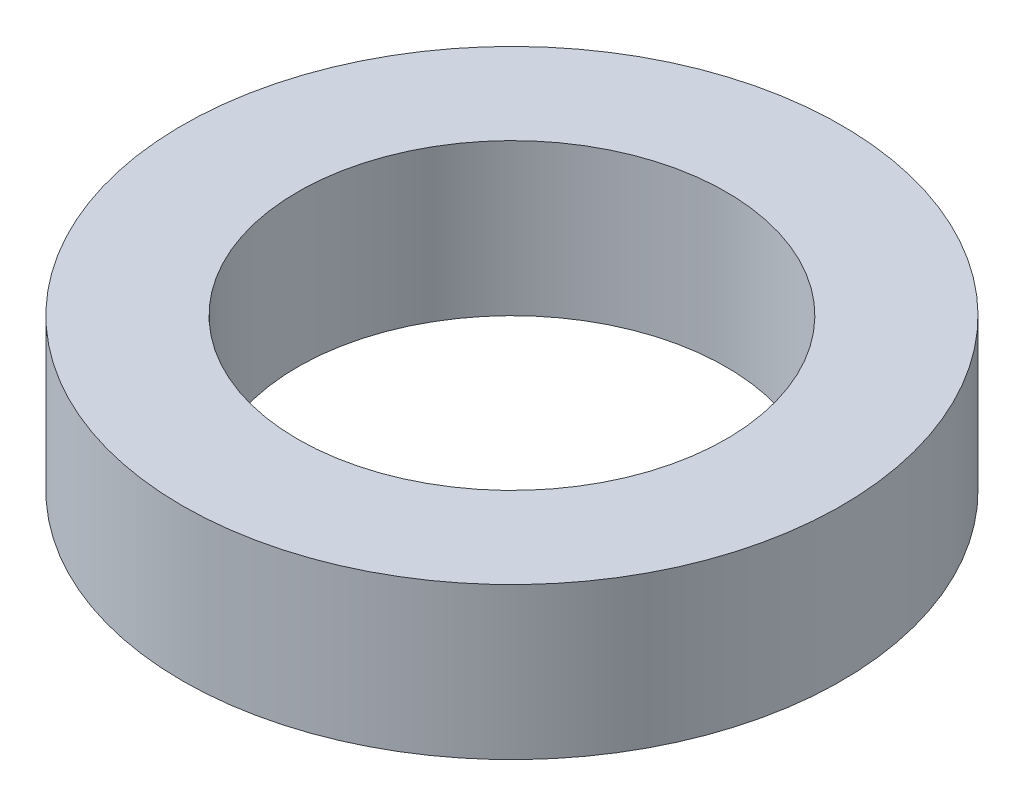
ISO-10303-21;
HEADER;
FILE_DESCRIPTION(('STEP AP214'),'2;1');
FILE_NAME('part.step','',(''),(''),'','','');
FILE_SCHEMA(('AUTOMOTIVE_DESIGN { 1 0 10303 214 1 1 1 1 }'));
ENDSEC;
DATA;
#1=APPLICATION_CONTEXT('core data for automotive mechanical design processes');
#2=APPLICATION_PROTOCOL_DEFINITION('international standard','automotive_design',2000,#1);
#3=PRODUCT_CONTEXT('',#1,'mechanical');
#4=PRODUCT('Part','Part','',(#3));
#5=PRODUCT_RELATED_PRODUCT_CATEGORY('part','',(#4));
#6=PRODUCT_DEFINITION_FORMATION('','',#4);
#7=PRODUCT_DEFINITION_CONTEXT('part definition',#1,'design');
#8=PRODUCT_DEFINITION('design','',#6,#7);
#9=PRODUCT_DEFINITION_SHAPE('','',#8);
#10=(LENGTH_UNIT() NAMED_UNIT(*) SI_UNIT(.MILLI.,.METRE.));
#11=(NAMED_UNIT(*) PLANE_ANGLE_UNIT() SI_UNIT($,.RADIAN.));
#12=(NAMED_UNIT(*) SI_UNIT($,.STERADIAN.) SOLID_ANGLE_UNIT());
#13=UNCERTAINTY_MEASURE_WITH_UNIT(LENGTH_MEASURE(1.E-05),#10,'distance_accuracy_value','');
#14=(GEOMETRIC_REPRESENTATION_CONTEXT(3) GLOBAL_UNCERTAINTY_ASSIGNED_CONTEXT((#13)) GLOBAL_UNIT_ASSIGNED_CONTEXT((#10,
#11,#12)) REPRESENTATION_CONTEXT('',''));
#15=CARTESIAN_POINT('',(0.,0.,0.));
#16=DIRECTION('',(0.,0.,1.));
#17=DIRECTION('',(1.,0.,0.));
#18=AXIS2_PLACEMENT_3D('',#15,#16,#17);
#19=CARTESIAN_POINT('',(0.,23.,0.));
#20=DIRECTION('',(0.,-1.,0.));
#21=DIRECTION('',(0.,0.,-1.));
#22=AXIS2_PLACEMENT_3D('',#19,#20,#21);
#23=CYLINDRICAL_SURFACE('',#22,50.);
#24=CARTESIAN_POINT('',(0.,23.,0.));
#25=DIRECTION('',(0.,1.,0.));
#26=DIRECTION('',(0.,0.,1.));
#27=AXIS2_PLACEMENT_3D('',#24,#25,#26);
#28=CIRCLE('',#27,50.);
#29=CARTESIAN_POINT('',(0.,23.,50.));
#30=VERTEX_POINT('',#29);
#31=EDGE_CURVE('E10',#30,#30,#28,.T.);
#32=ORIENTED_EDGE('',*,*,#31,.F.);
#33=EDGE_LOOP('',(#32));
#34=FACE_BOUND('',#33,.T.);
#35=CARTESIAN_POINT('',(0.,0.,0.));
#36=DIRECTION('',(0.,1.,0.));
#37=DIRECTION('',(0.,0.,1.));
#38=AXIS2_PLACEMENT_3D('',#35,#36,#37);
#39=CIRCLE('',#38,50.);
#40=CARTESIAN_POINT('',(0.,0.,50.));
#41=VERTEX_POINT('',#40);
#42=EDGE_CURVE('E37',#41,#41,#39,.T.);
#43=ORIENTED_EDGE('',*,*,#42,.T.);
#44=EDGE_LOOP('',(#43));
#45=FACE_BOUND('',#44,.T.);
#46=ADVANCED_FACE('F40',(#34,#45),#23,.T.);
#47=CARTESIAN_POINT('',(0.,23.,0.));
#48=DIRECTION('',(0.,1.,0.));
#49=DIRECTION('',(0.,0.,1.));
#50=AXIS2_PLACEMENT_3D('',#47,#48,#49);
#51=PLANE('',#50);
#52=CARTESIAN_POINT('',(0.,23.,0.));
#53=DIRECTION('',(0.,1.,0.));
#54=DIRECTION('',(0.,0.,1.));
#55=AXIS2_PLACEMENT_3D('',#52,#53,#54);
#56=CIRCLE('',#55,32.5);
#57=CARTESIAN_POINT('',(0.,23.,32.5));
#58=VERTEX_POINT('',#57);
#59=EDGE_CURVE('E50',#58,#58,#56,.T.);
#60=ORIENTED_EDGE('',*,*,#59,.F.);
#61=EDGE_LOOP('',(#60));
#62=FACE_BOUND('',#61,.T.);
#63=ORIENTED_EDGE('',*,*,#31,.T.);
#64=EDGE_LOOP('',(#63));
#65=FACE_BOUND('',#64,.T.);
#66=ADVANCED_FACE('F59',(#62,#65),#51,.T.);
#67=CARTESIAN_POINT('',(0.,0.,0.));
#68=DIRECTION('',(0.,1.,0.));
#69=DIRECTION('',(0.,0.,1.));
#70=AXIS2_PLACEMENT_3D('',#67,#68,#69);
#71=PLANE('',#70);
#72=CARTESIAN_POINT('',(0.,0.,0.));
#73=DIRECTION('',(0.,1.,0.));
#74=DIRECTION('',(0.,0.,1.));
#75=AXIS2_PLACEMENT_3D('',#72,#73,#74);
#76=CIRCLE('',#75,32.5);
#77=CARTESIAN_POINT('',(0.,0.,32.5));
#78=VERTEX_POINT('',#77);
#79=EDGE_CURVE('E47',#78,#78,#76,.T.);
#80=ORIENTED_EDGE('',*,*,#79,.T.);
#81=EDGE_LOOP('',(#80));
#82=FACE_BOUND('',#81,.T.);
#83=ORIENTED_EDGE('',*,*,#42,.F.);
#84=EDGE_LOOP('',(#83));
#85=FACE_BOUND('',#84,.T.);
#86=ADVANCED_FACE('F58',(#82,#85),#71,.F.);
#87=CARTESIAN_POINT('',(0.,23.,0.));
#88=DIRECTION('',(0.,-1.,0.));
#89=DIRECTION('',(0.,0.,-1.));
#90=AXIS2_PLACEMENT_3D('',#87,#88,#89);
#91=CYLINDRICAL_SURFACE('',#90,32.5);
#92=ORIENTED_EDGE('',*,*,#59,.T.);
#93=EDGE_LOOP('',(#92));
#94=FACE_BOUND('',#93,.T.);
#95=ORIENTED_EDGE('',*,*,#79,.F.);
#96=EDGE_LOOP('',(#95));
#97=FACE_BOUND('',#96,.T.);
#98=ADVANCED_FACE('F54',(#94,#97),#91,.F.);
#99=CLOSED_SHELL('',(#46,#66,#86,#98));
#100=MANIFOLD_SOLID_BREP('B2',#99);
#101=ADVANCED_BREP_SHAPE_REPRESENTATION('',(#18,#100),#14);
#102=SHAPE_DEFINITION_REPRESENTATION(#9,#101);
ENDSEC;
END-ISO-10303-21;
